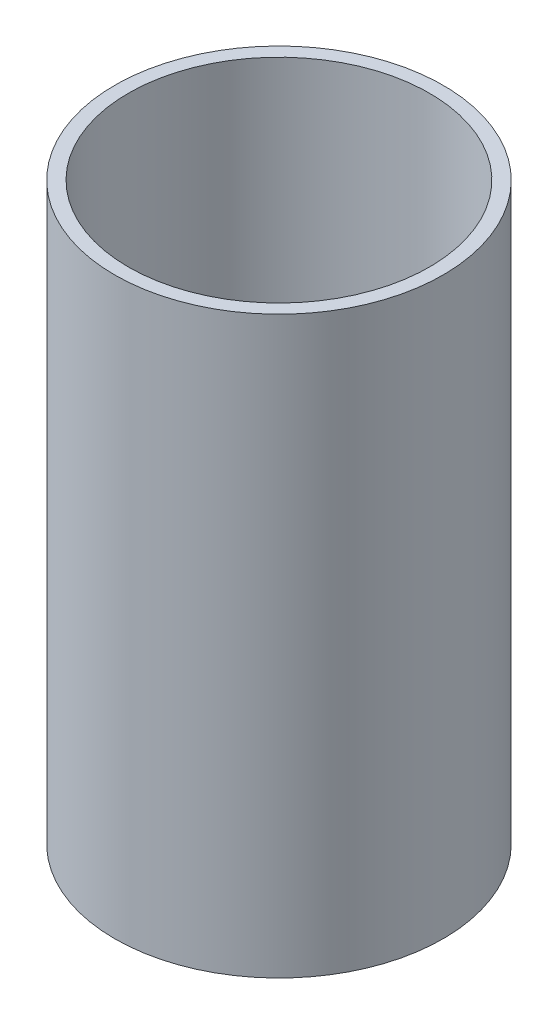
ISO-10303-21;
HEADER;
FILE_DESCRIPTION(('STEP AP214'),'2;1');
FILE_NAME('part.step','',(''),(''),'','','');
FILE_SCHEMA(('AUTOMOTIVE_DESIGN { 1 0 10303 214 1 1 1 1 }'));
ENDSEC;
DATA;
#1=APPLICATION_CONTEXT('core data for automotive mechanical design processes');
#2=APPLICATION_PROTOCOL_DEFINITION('international standard','automotive_design',2000,#1);
#3=PRODUCT_CONTEXT('',#1,'mechanical');
#4=PRODUCT('Part','Part','',(#3));
#5=PRODUCT_RELATED_PRODUCT_CATEGORY('part','',(#4));
#6=PRODUCT_DEFINITION_FORMATION('','',#4);
#7=PRODUCT_DEFINITION_CONTEXT('part definition',#1,'design');
#8=PRODUCT_DEFINITION('design','',#6,#7);
#9=PRODUCT_DEFINITION_SHAPE('','',#8);
#10=(LENGTH_UNIT() NAMED_UNIT(*) SI_UNIT(.MILLI.,.METRE.));
#11=(NAMED_UNIT(*) PLANE_ANGLE_UNIT() SI_UNIT($,.RADIAN.));
#12=(NAMED_UNIT(*) SI_UNIT($,.STERADIAN.) SOLID_ANGLE_UNIT());
#13=UNCERTAINTY_MEASURE_WITH_UNIT(LENGTH_MEASURE(1.E-05),#10,'distance_accuracy_value','');
#14=(GEOMETRIC_REPRESENTATION_CONTEXT(3) GLOBAL_UNCERTAINTY_ASSIGNED_CONTEXT((#13)) GLOBAL_UNIT_ASSIGNED_CONTEXT((#10,
#11,#12)) REPRESENTATION_CONTEXT('',''));
#15=CARTESIAN_POINT('',(0.,0.,0.));
#16=DIRECTION('',(0.,0.,1.));
#17=DIRECTION('',(1.,0.,0.));
#18=AXIS2_PLACEMENT_3D('',#15,#16,#17);
#19=CARTESIAN_POINT('',(0.,21.,0.));
#20=DIRECTION('',(0.,1.,0.));
#21=DIRECTION('',(0.,0.,1.));
#22=AXIS2_PLACEMENT_3D('',#19,#20,#21);
#23=PLANE('',#22);
#24=CARTESIAN_POINT('',(0.,21.,0.));
#25=DIRECTION('',(0.,1.,0.));
#26=DIRECTION('',(0.,0.,1.));
#27=AXIS2_PLACEMENT_3D('',#24,#25,#26);
#28=CIRCLE('',#27,12.);
#29=CARTESIAN_POINT('',(0.,21.,12.));
#30=VERTEX_POINT('',#29);
#31=EDGE_CURVE('E10',#30,#30,#28,.T.);
#32=ORIENTED_EDGE('',*,*,#31,.T.);
#33=EDGE_LOOP('',(#32));
#34=FACE_BOUND('',#33,.T.);
#35=CARTESIAN_POINT('',(0.,21.,0.));
#36=DIRECTION('',(0.,1.,0.));
#37=DIRECTION('',(0.,0.,1.));
#38=AXIS2_PLACEMENT_3D('',#35,#36,#37);
#39=CIRCLE('',#38,11.);
#40=CARTESIAN_POINT('',(0.,21.,11.));
#41=VERTEX_POINT('',#40);
#42=EDGE_CURVE('E50',#41,#41,#39,.T.);
#43=ORIENTED_EDGE('',*,*,#42,.F.);
#44=EDGE_LOOP('',(#43));
#45=FACE_BOUND('',#44,.T.);
#46=ADVANCED_FACE('F37',(#34,#45),#23,.T.);
#47=CARTESIAN_POINT('',(0.,-21.,0.));
#48=DIRECTION('',(0.,1.,0.));
#49=DIRECTION('',(0.,0.,1.));
#50=AXIS2_PLACEMENT_3D('',#47,#48,#49);
#51=PLANE('',#50);
#52=CARTESIAN_POINT('',(0.,-21.,0.));
#53=DIRECTION('',(0.,1.,0.));
#54=DIRECTION('',(0.,0.,1.));
#55=AXIS2_PLACEMENT_3D('',#52,#53,#54);
#56=CIRCLE('',#55,12.);
#57=CARTESIAN_POINT('',(0.,-21.,12.));
#58=VERTEX_POINT('',#57);
#59=EDGE_CURVE('E41',#58,#58,#56,.T.);
#60=ORIENTED_EDGE('',*,*,#59,.F.);
#61=EDGE_LOOP('',(#60));
#62=FACE_BOUND('',#61,.T.);
#63=CARTESIAN_POINT('',(0.,-21.,0.));
#64=DIRECTION('',(0.,1.,0.));
#65=DIRECTION('',(0.,0.,1.));
#66=AXIS2_PLACEMENT_3D('',#63,#64,#65);
#67=CIRCLE('',#66,11.);
#68=CARTESIAN_POINT('',(0.,-21.,11.));
#69=VERTEX_POINT('',#68);
#70=EDGE_CURVE('E52',#69,#69,#67,.T.);
#71=ORIENTED_EDGE('',*,*,#70,.T.);
#72=EDGE_LOOP('',(#71));
#73=FACE_BOUND('',#72,.T.);
#74=ADVANCED_FACE('F64',(#62,#73),#51,.F.);
#75=CARTESIAN_POINT('',(0.,21.,0.));
#76=DIRECTION('',(0.,-1.,0.));
#77=DIRECTION('',(0.,0.,-1.));
#78=AXIS2_PLACEMENT_3D('',#75,#76,#77);
#79=CYLINDRICAL_SURFACE('',#78,12.);
#80=ORIENTED_EDGE('',*,*,#31,.F.);
#81=EDGE_LOOP('',(#80));
#82=FACE_BOUND('',#81,.T.);
#83=ORIENTED_EDGE('',*,*,#59,.T.);
#84=EDGE_LOOP('',(#83));
#85=FACE_BOUND('',#84,.T.);
#86=ADVANCED_FACE('F39',(#82,#85),#79,.T.);
#87=CARTESIAN_POINT('',(0.,21.,0.));
#88=DIRECTION('',(0.,-1.,0.));
#89=DIRECTION('',(0.,0.,-1.));
#90=AXIS2_PLACEMENT_3D('',#87,#88,#89);
#91=CYLINDRICAL_SURFACE('',#90,11.);
#92=ORIENTED_EDGE('',*,*,#42,.T.);
#93=EDGE_LOOP('',(#92));
#94=FACE_BOUND('',#93,.T.);
#95=ORIENTED_EDGE('',*,*,#70,.F.);
#96=EDGE_LOOP('',(#95));
#97=FACE_BOUND('',#96,.T.);
#98=ADVANCED_FACE('F60',(#94,#97),#91,.F.);
#99=CLOSED_SHELL('',(#46,#74,#86,#98));
#100=MANIFOLD_SOLID_BREP('B2',#99);
#101=ADVANCED_BREP_SHAPE_REPRESENTATION('',(#18,#100),#14);
#102=SHAPE_DEFINITION_REPRESENTATION(#9,#101);
ENDSEC;
END-ISO-10303-21;
